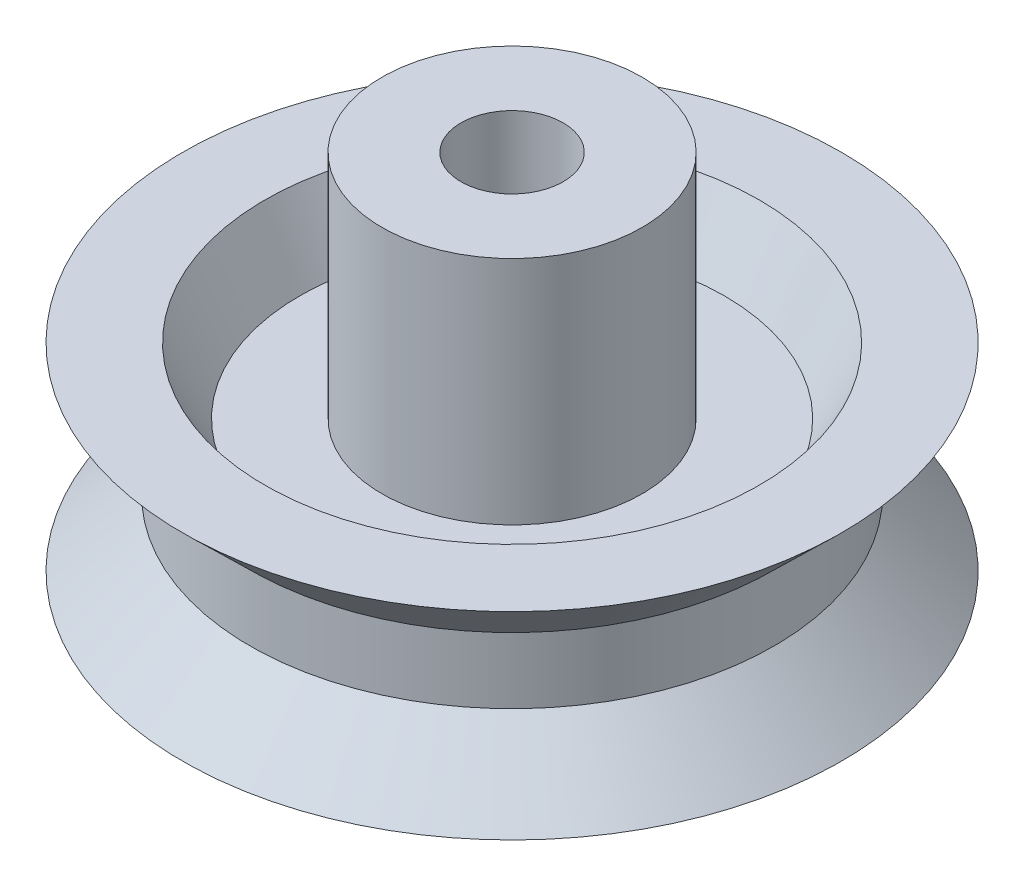
ISO-10303-21;
HEADER;
FILE_DESCRIPTION(('STEP AP214'),'2;1');
FILE_NAME('part.step','',(''),(''),'','','');
FILE_SCHEMA(('AUTOMOTIVE_DESIGN { 1 0 10303 214 1 1 1 1 }'));
ENDSEC;
DATA;
#1=APPLICATION_CONTEXT('core data for automotive mechanical design processes');
#2=APPLICATION_PROTOCOL_DEFINITION('international standard','automotive_design',2000,#1);
#3=PRODUCT_CONTEXT('',#1,'mechanical');
#4=PRODUCT('Part','Part','',(#3));
#5=PRODUCT_RELATED_PRODUCT_CATEGORY('part','',(#4));
#6=PRODUCT_DEFINITION_FORMATION('','',#4);
#7=PRODUCT_DEFINITION_CONTEXT('part definition',#1,'design');
#8=PRODUCT_DEFINITION('design','',#6,#7);
#9=PRODUCT_DEFINITION_SHAPE('','',#8);
#10=(LENGTH_UNIT() NAMED_UNIT(*) SI_UNIT(.MILLI.,.METRE.));
#11=(NAMED_UNIT(*) PLANE_ANGLE_UNIT() SI_UNIT($,.RADIAN.));
#12=(NAMED_UNIT(*) SI_UNIT($,.STERADIAN.) SOLID_ANGLE_UNIT());
#13=UNCERTAINTY_MEASURE_WITH_UNIT(LENGTH_MEASURE(1.E-05),#10,'distance_accuracy_value','');
#14=(GEOMETRIC_REPRESENTATION_CONTEXT(3) GLOBAL_UNCERTAINTY_ASSIGNED_CONTEXT((#13)) GLOBAL_UNIT_ASSIGNED_CONTEXT((#10,
#11,#12)) REPRESENTATION_CONTEXT('',''));
#15=CARTESIAN_POINT('',(0.,0.,0.));
#16=DIRECTION('',(0.,0.,1.));
#17=DIRECTION('',(1.,0.,0.));
#18=AXIS2_PLACEMENT_3D('',#15,#16,#17);
#19=CARTESIAN_POINT('',(0.,-10.3546306504961,0.));
#20=DIRECTION('',(0.,-1.,0.));
#21=DIRECTION('',(0.,0.,-1.));
#22=AXIS2_PLACEMENT_3D('',#19,#20,#21);
#23=CYLINDRICAL_SURFACE('',#22,1.55);
#24=CARTESIAN_POINT('',(0.,0.,0.));
#25=DIRECTION('',(0.,-1.,0.));
#26=DIRECTION('',(0.,0.,-1.));
#27=AXIS2_PLACEMENT_3D('',#24,#25,#26);
#28=CIRCLE('',#27,1.55);
#29=CARTESIAN_POINT('',(0.,0.,-1.55));
#30=VERTEX_POINT('',#29);
#31=EDGE_CURVE('E10',#30,#30,#28,.T.);
#32=ORIENTED_EDGE('',*,*,#31,.T.);
#33=EDGE_LOOP('',(#32));
#34=FACE_BOUND('',#33,.T.);
#35=CARTESIAN_POINT('',(0.,11.,0.));
#36=DIRECTION('',(0.,-1.,0.));
#37=DIRECTION('',(0.,0.,-1.));
#38=AXIS2_PLACEMENT_3D('',#35,#36,#37);
#39=CIRCLE('',#38,1.55);
#40=CARTESIAN_POINT('',(0.,11.,-1.55));
#41=VERTEX_POINT('',#40);
#42=EDGE_CURVE('E70',#41,#41,#39,.T.);
#43=ORIENTED_EDGE('',*,*,#42,.F.);
#44=EDGE_LOOP('',(#43));
#45=FACE_BOUND('',#44,.T.);
#46=ADVANCED_FACE('F24',(#34,#45),#23,.F.);
#47=CARTESIAN_POINT('',(0.,0.,-1.55));
#48=DIRECTION('',(0.,-1.,0.));
#49=DIRECTION('',(0.,0.,-1.));
#50=AXIS2_PLACEMENT_3D('',#47,#48,#49);
#51=PLANE('',#50);
#52=CARTESIAN_POINT('',(0.,0.,0.));
#53=DIRECTION('',(0.,-1.,0.));
#54=DIRECTION('',(0.,0.,-1.));
#55=AXIS2_PLACEMENT_3D('',#52,#53,#54);
#56=CIRCLE('',#55,3.95);
#57=CARTESIAN_POINT('',(0.,0.,-3.95));
#58=VERTEX_POINT('',#57);
#59=EDGE_CURVE('E30',#58,#58,#56,.T.);
#60=ORIENTED_EDGE('',*,*,#59,.T.);
#61=EDGE_LOOP('',(#60));
#62=FACE_BOUND('',#61,.T.);
#63=ORIENTED_EDGE('',*,*,#31,.F.);
#64=EDGE_LOOP('',(#63));
#65=FACE_BOUND('',#64,.T.);
#66=ADVANCED_FACE('F78',(#62,#65),#51,.T.);
#67=CARTESIAN_POINT('',(0.,-10.3546306504961,0.));
#68=DIRECTION('',(0.,-1.,0.));
#69=DIRECTION('',(0.,0.,-1.));
#70=AXIS2_PLACEMENT_3D('',#67,#68,#69);
#71=CYLINDRICAL_SURFACE('',#70,3.95);
#72=CARTESIAN_POINT('',(0.,2.,0.));
#73=DIRECTION('',(0.,-1.,0.));
#74=DIRECTION('',(0.,0.,-1.));
#75=AXIS2_PLACEMENT_3D('',#72,#73,#74);
#76=CIRCLE('',#75,3.95);
#77=CARTESIAN_POINT('',(0.,2.,-3.95));
#78=VERTEX_POINT('',#77);
#79=EDGE_CURVE('E34',#78,#78,#76,.T.);
#80=ORIENTED_EDGE('',*,*,#79,.T.);
#81=EDGE_LOOP('',(#80));
#82=FACE_BOUND('',#81,.T.);
#83=ORIENTED_EDGE('',*,*,#59,.F.);
#84=EDGE_LOOP('',(#83));
#85=FACE_BOUND('',#84,.T.);
#86=ADVANCED_FACE('F82',(#82,#85),#71,.T.);
#87=CARTESIAN_POINT('',(0.,2.,-3.95));
#88=DIRECTION('',(0.,-1.,0.));
#89=DIRECTION('',(0.,0.,-1.));
#90=AXIS2_PLACEMENT_3D('',#87,#88,#89);
#91=PLANE('',#90);
#92=CARTESIAN_POINT('',(0.,2.,0.));
#93=DIRECTION('',(0.,-1.,0.));
#94=DIRECTION('',(0.,0.,-1.));
#95=AXIS2_PLACEMENT_3D('',#92,#93,#94);
#96=CIRCLE('',#95,6.45);
#97=CARTESIAN_POINT('',(0.,2.,-6.45));
#98=VERTEX_POINT('',#97);
#99=EDGE_CURVE('E38',#98,#98,#96,.T.);
#100=ORIENTED_EDGE('',*,*,#99,.T.);
#101=EDGE_LOOP('',(#100));
#102=FACE_BOUND('',#101,.T.);
#103=ORIENTED_EDGE('',*,*,#79,.F.);
#104=EDGE_LOOP('',(#103));
#105=FACE_BOUND('',#104,.T.);
#106=ADVANCED_FACE('F86',(#102,#105),#91,.T.);
#107=CARTESIAN_POINT('',(0.,2.,0.));
#108=DIRECTION('',(0.,-1.,0.));
#109=DIRECTION('',(0.,0.,-1.));
#110=AXIS2_PLACEMENT_3D('',#107,#108,#109);
#111=CONICAL_SURFACE('',#110,6.45,0.483447001567199);
#112=CARTESIAN_POINT('',(0.,0.,0.));
#113=DIRECTION('',(0.,-1.,0.));
#114=DIRECTION('',(0.,0.,-1.));
#115=AXIS2_PLACEMENT_3D('',#112,#113,#114);
#116=CIRCLE('',#115,7.5);
#117=CARTESIAN_POINT('',(0.,0.,-7.5));
#118=VERTEX_POINT('',#117);
#119=EDGE_CURVE('E43',#118,#118,#116,.T.);
#120=ORIENTED_EDGE('',*,*,#119,.T.);
#121=EDGE_LOOP('',(#120));
#122=FACE_BOUND('',#121,.T.);
#123=ORIENTED_EDGE('',*,*,#99,.F.);
#124=EDGE_LOOP('',(#123));
#125=FACE_BOUND('',#124,.T.);
#126=ADVANCED_FACE('F93',(#122,#125),#111,.F.);
#127=CARTESIAN_POINT('',(0.,0.,-7.5));
#128=DIRECTION('',(0.,-1.,0.));
#129=DIRECTION('',(0.,0.,-1.));
#130=AXIS2_PLACEMENT_3D('',#127,#128,#129);
#131=PLANE('',#130);
#132=CARTESIAN_POINT('',(0.,0.,0.));
#133=DIRECTION('',(0.,-1.,0.));
#134=DIRECTION('',(0.,0.,-1.));
#135=AXIS2_PLACEMENT_3D('',#132,#133,#134);
#136=CIRCLE('',#135,10.);
#137=CARTESIAN_POINT('',(0.,0.,-10.));
#138=VERTEX_POINT('',#137);
#139=EDGE_CURVE('E46',#138,#138,#136,.T.);
#140=ORIENTED_EDGE('',*,*,#139,.T.);
#141=EDGE_LOOP('',(#140));
#142=FACE_BOUND('',#141,.T.);
#143=ORIENTED_EDGE('',*,*,#119,.F.);
#144=EDGE_LOOP('',(#143));
#145=FACE_BOUND('',#144,.T.);
#146=ADVANCED_FACE('F97',(#142,#145),#131,.T.);
#147=CARTESIAN_POINT('',(0.,0.,0.));
#148=DIRECTION('',(0.,-1.,0.));
#149=DIRECTION('',(0.,0.,-1.));
#150=AXIS2_PLACEMENT_3D('',#147,#148,#149);
#151=CONICAL_SURFACE('',#150,10.,0.797743215241672);
#152=CARTESIAN_POINT('',(0.,2.,0.));
#153=DIRECTION('',(0.,-1.,0.));
#154=DIRECTION('',(0.,0.,-1.));
#155=AXIS2_PLACEMENT_3D('',#152,#153,#154);
#156=CIRCLE('',#155,7.95);
#157=CARTESIAN_POINT('',(0.,2.,-7.95));
#158=VERTEX_POINT('',#157);
#159=EDGE_CURVE('E49',#158,#158,#156,.T.);
#160=ORIENTED_EDGE('',*,*,#159,.T.);
#161=EDGE_LOOP('',(#160));
#162=FACE_BOUND('',#161,.T.);
#163=ORIENTED_EDGE('',*,*,#139,.F.);
#164=EDGE_LOOP('',(#163));
#165=FACE_BOUND('',#164,.T.);
#166=ADVANCED_FACE('F101',(#162,#165),#151,.T.);
#167=CARTESIAN_POINT('',(0.,-10.3546306504961,0.));
#168=DIRECTION('',(0.,-1.,0.));
#169=DIRECTION('',(0.,0.,-1.));
#170=AXIS2_PLACEMENT_3D('',#167,#168,#169);
#171=CYLINDRICAL_SURFACE('',#170,7.95);
#172=CARTESIAN_POINT('',(0.,4.,0.));
#173=DIRECTION('',(0.,-1.,0.));
#174=DIRECTION('',(0.,0.,-1.));
#175=AXIS2_PLACEMENT_3D('',#172,#173,#174);
#176=CIRCLE('',#175,7.95);
#177=CARTESIAN_POINT('',(0.,4.,-7.95));
#178=VERTEX_POINT('',#177);
#179=EDGE_CURVE('E52',#178,#178,#176,.T.);
#180=ORIENTED_EDGE('',*,*,#179,.T.);
#181=EDGE_LOOP('',(#180));
#182=FACE_BOUND('',#181,.T.);
#183=ORIENTED_EDGE('',*,*,#159,.F.);
#184=EDGE_LOOP('',(#183));
#185=FACE_BOUND('',#184,.T.);
#186=ADVANCED_FACE('F105',(#182,#185),#171,.T.);
#187=CARTESIAN_POINT('',(0.,4.,0.));
#188=DIRECTION('',(0.,1.,0.));
#189=DIRECTION('',(0.,0.,1.));
#190=AXIS2_PLACEMENT_3D('',#187,#188,#189);
#191=CONICAL_SURFACE('',#190,7.95,0.797743215241673);
#192=CARTESIAN_POINT('',(0.,6.,0.));
#193=DIRECTION('',(0.,-1.,0.));
#194=DIRECTION('',(0.,0.,-1.));
#195=AXIS2_PLACEMENT_3D('',#192,#193,#194);
#196=CIRCLE('',#195,10.);
#197=CARTESIAN_POINT('',(0.,6.,-10.));
#198=VERTEX_POINT('',#197);
#199=EDGE_CURVE('E55',#198,#198,#196,.T.);
#200=ORIENTED_EDGE('',*,*,#199,.T.);
#201=EDGE_LOOP('',(#200));
#202=FACE_BOUND('',#201,.T.);
#203=ORIENTED_EDGE('',*,*,#179,.F.);
#204=EDGE_LOOP('',(#203));
#205=FACE_BOUND('',#204,.T.);
#206=ADVANCED_FACE('F109',(#202,#205),#191,.T.);
#207=CARTESIAN_POINT('',(0.,6.,-10.));
#208=DIRECTION('',(0.,1.,0.));
#209=DIRECTION('',(0.,0.,1.));
#210=AXIS2_PLACEMENT_3D('',#207,#208,#209);
#211=PLANE('',#210);
#212=CARTESIAN_POINT('',(0.,6.,0.));
#213=DIRECTION('',(0.,-1.,0.));
#214=DIRECTION('',(0.,0.,-1.));
#215=AXIS2_PLACEMENT_3D('',#212,#213,#214);
#216=CIRCLE('',#215,7.5);
#217=CARTESIAN_POINT('',(0.,6.,-7.5));
#218=VERTEX_POINT('',#217);
#219=EDGE_CURVE('E58',#218,#218,#216,.T.);
#220=ORIENTED_EDGE('',*,*,#219,.T.);
#221=EDGE_LOOP('',(#220));
#222=FACE_BOUND('',#221,.T.);
#223=ORIENTED_EDGE('',*,*,#199,.F.);
#224=EDGE_LOOP('',(#223));
#225=FACE_BOUND('',#224,.T.);
#226=ADVANCED_FACE('F113',(#222,#225),#211,.T.);
#227=CARTESIAN_POINT('',(0.,6.,0.));
#228=DIRECTION('',(0.,1.,0.));
#229=DIRECTION('',(0.,0.,1.));
#230=AXIS2_PLACEMENT_3D('',#227,#228,#229);
#231=CONICAL_SURFACE('',#230,7.5,0.483447001567198);
#232=CARTESIAN_POINT('',(0.,4.,0.));
#233=DIRECTION('',(0.,-1.,0.));
#234=DIRECTION('',(0.,0.,-1.));
#235=AXIS2_PLACEMENT_3D('',#232,#233,#234);
#236=CIRCLE('',#235,6.45);
#237=CARTESIAN_POINT('',(0.,4.,-6.45));
#238=VERTEX_POINT('',#237);
#239=EDGE_CURVE('E61',#238,#238,#236,.T.);
#240=ORIENTED_EDGE('',*,*,#239,.T.);
#241=EDGE_LOOP('',(#240));
#242=FACE_BOUND('',#241,.T.);
#243=ORIENTED_EDGE('',*,*,#219,.F.);
#244=EDGE_LOOP('',(#243));
#245=FACE_BOUND('',#244,.T.);
#246=ADVANCED_FACE('F117',(#242,#245),#231,.F.);
#247=CARTESIAN_POINT('',(0.,4.,-6.45));
#248=DIRECTION('',(0.,1.,0.));
#249=DIRECTION('',(0.,0.,1.));
#250=AXIS2_PLACEMENT_3D('',#247,#248,#249);
#251=PLANE('',#250);
#252=CARTESIAN_POINT('',(0.,4.,0.));
#253=DIRECTION('',(0.,-1.,0.));
#254=DIRECTION('',(0.,0.,-1.));
#255=AXIS2_PLACEMENT_3D('',#252,#253,#254);
#256=CIRCLE('',#255,3.95);
#257=CARTESIAN_POINT('',(0.,4.,-3.95));
#258=VERTEX_POINT('',#257);
#259=EDGE_CURVE('E64',#258,#258,#256,.T.);
#260=ORIENTED_EDGE('',*,*,#259,.T.);
#261=EDGE_LOOP('',(#260));
#262=FACE_BOUND('',#261,.T.);
#263=ORIENTED_EDGE('',*,*,#239,.F.);
#264=EDGE_LOOP('',(#263));
#265=FACE_BOUND('',#264,.T.);
#266=ADVANCED_FACE('F121',(#262,#265),#251,.T.);
#267=CARTESIAN_POINT('',(0.,-10.3546306504961,0.));
#268=DIRECTION('',(0.,-1.,0.));
#269=DIRECTION('',(0.,0.,-1.));
#270=AXIS2_PLACEMENT_3D('',#267,#268,#269);
#271=CYLINDRICAL_SURFACE('',#270,3.95);
#272=CARTESIAN_POINT('',(0.,11.,0.));
#273=DIRECTION('',(0.,-1.,0.));
#274=DIRECTION('',(0.,0.,-1.));
#275=AXIS2_PLACEMENT_3D('',#272,#273,#274);
#276=CIRCLE('',#275,3.95);
#277=CARTESIAN_POINT('',(0.,11.,-3.95));
#278=VERTEX_POINT('',#277);
#279=EDGE_CURVE('E67',#278,#278,#276,.T.);
#280=ORIENTED_EDGE('',*,*,#279,.T.);
#281=EDGE_LOOP('',(#280));
#282=FACE_BOUND('',#281,.T.);
#283=ORIENTED_EDGE('',*,*,#259,.F.);
#284=EDGE_LOOP('',(#283));
#285=FACE_BOUND('',#284,.T.);
#286=ADVANCED_FACE('F125',(#282,#285),#271,.T.);
#287=CARTESIAN_POINT('',(0.,11.,-3.95));
#288=DIRECTION('',(0.,1.,0.));
#289=DIRECTION('',(0.,0.,1.));
#290=AXIS2_PLACEMENT_3D('',#287,#288,#289);
#291=PLANE('',#290);
#292=ORIENTED_EDGE('',*,*,#42,.T.);
#293=EDGE_LOOP('',(#292));
#294=FACE_BOUND('',#293,.T.);
#295=ORIENTED_EDGE('',*,*,#279,.F.);
#296=EDGE_LOOP('',(#295));
#297=FACE_BOUND('',#296,.T.);
#298=ADVANCED_FACE('F74',(#294,#297),#291,.T.);
#299=CLOSED_SHELL('',(#46,#66,#86,#106,#126,#146,#166,#186,#206,#226,#246,#266,#286,#298));
#300=MANIFOLD_SOLID_BREP('B2',#299);
#301=ADVANCED_BREP_SHAPE_REPRESENTATION('',(#18,#300),#14);
#302=SHAPE_DEFINITION_REPRESENTATION(#9,#301);
ENDSEC;
END-ISO-10303-21;
